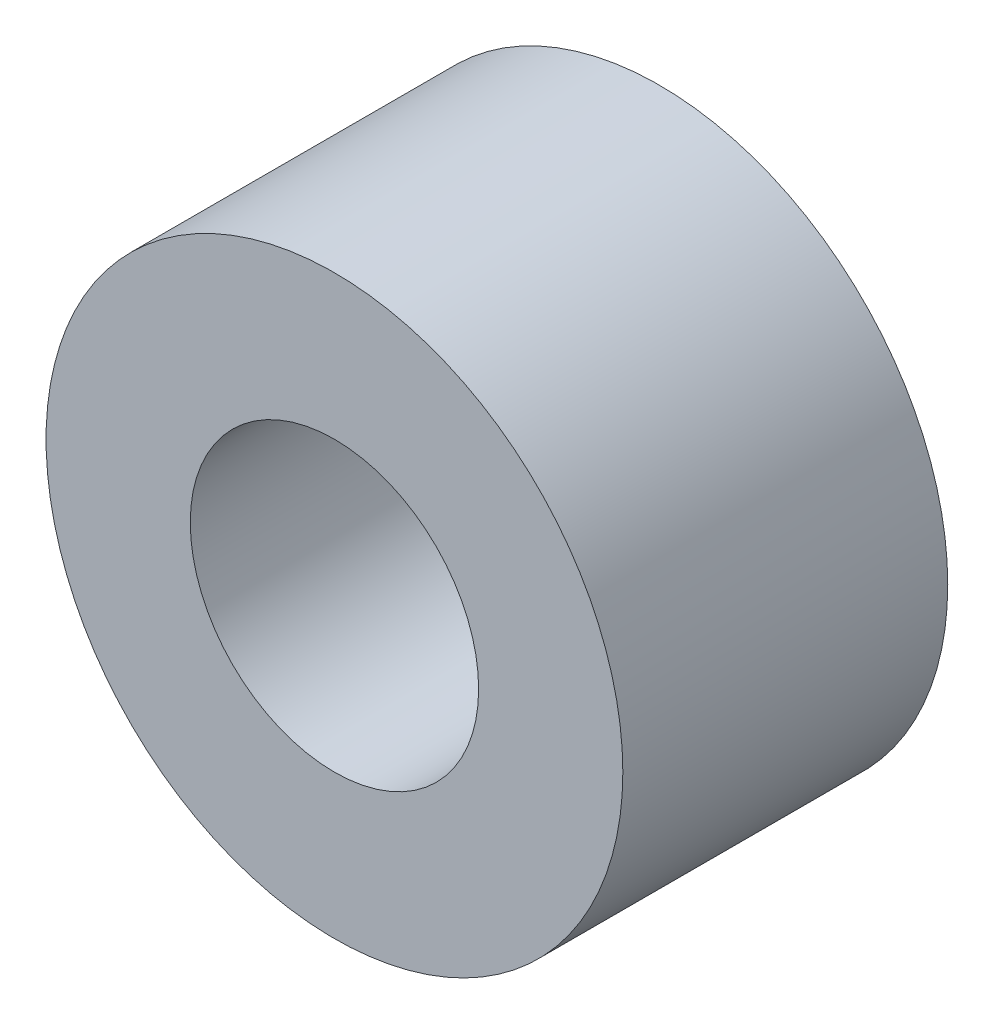
ISO-10303-21;
HEADER;
FILE_DESCRIPTION(('STEP AP214'),'2;1');
FILE_NAME('part.step','',(''),(''),'','','');
FILE_SCHEMA(('AUTOMOTIVE_DESIGN { 1 0 10303 214 1 1 1 1 }'));
ENDSEC;
DATA;
#1=APPLICATION_CONTEXT('core data for automotive mechanical design processes');
#2=APPLICATION_PROTOCOL_DEFINITION('international standard','automotive_design',2000,#1);
#3=PRODUCT_CONTEXT('',#1,'mechanical');
#4=PRODUCT('Part','Part','',(#3));
#5=PRODUCT_RELATED_PRODUCT_CATEGORY('part','',(#4));
#6=PRODUCT_DEFINITION_FORMATION('','',#4);
#7=PRODUCT_DEFINITION_CONTEXT('part definition',#1,'design');
#8=PRODUCT_DEFINITION('design','',#6,#7);
#9=PRODUCT_DEFINITION_SHAPE('','',#8);
#10=(LENGTH_UNIT() NAMED_UNIT(*) SI_UNIT(.MILLI.,.METRE.));
#11=(NAMED_UNIT(*) PLANE_ANGLE_UNIT() SI_UNIT($,.RADIAN.));
#12=(NAMED_UNIT(*) SI_UNIT($,.STERADIAN.) SOLID_ANGLE_UNIT());
#13=UNCERTAINTY_MEASURE_WITH_UNIT(LENGTH_MEASURE(1.E-05),#10,'distance_accuracy_value','');
#14=(GEOMETRIC_REPRESENTATION_CONTEXT(3) GLOBAL_UNCERTAINTY_ASSIGNED_CONTEXT((#13)) GLOBAL_UNIT_ASSIGNED_CONTEXT((#10,
#11,#12)) REPRESENTATION_CONTEXT('',''));
#15=CARTESIAN_POINT('',(0.,0.,0.));
#16=DIRECTION('',(0.,0.,1.));
#17=DIRECTION('',(1.,0.,0.));
#18=AXIS2_PLACEMENT_3D('',#15,#16,#17);
#19=CARTESIAN_POINT('',(0.,0.,3.38));
#20=DIRECTION('',(0.,0.,1.));
#21=DIRECTION('',(1.,0.,0.));
#22=AXIS2_PLACEMENT_3D('',#19,#20,#21);
#23=PLANE('',#22);
#24=CARTESIAN_POINT('',(0.,0.,3.38));
#25=DIRECTION('',(0.,0.,1.));
#26=DIRECTION('',(1.,0.,0.));
#27=AXIS2_PLACEMENT_3D('',#24,#25,#26);
#28=CIRCLE('',#27,3.);
#29=CARTESIAN_POINT('',(3.,0.,3.38));
#30=VERTEX_POINT('',#29);
#31=EDGE_CURVE('E10',#30,#30,#28,.T.);
#32=ORIENTED_EDGE('',*,*,#31,.T.);
#33=EDGE_LOOP('',(#32));
#34=FACE_BOUND('',#33,.T.);
#35=CARTESIAN_POINT('',(0.,0.,3.38));
#36=DIRECTION('',(0.,0.,1.));
#37=DIRECTION('',(1.,0.,0.));
#38=AXIS2_PLACEMENT_3D('',#35,#36,#37);
#39=CIRCLE('',#38,1.5);
#40=CARTESIAN_POINT('',(1.5,0.,3.38));
#41=VERTEX_POINT('',#40);
#42=EDGE_CURVE('E43',#41,#41,#39,.T.);
#43=ORIENTED_EDGE('',*,*,#42,.F.);
#44=EDGE_LOOP('',(#43));
#45=FACE_BOUND('',#44,.T.);
#46=ADVANCED_FACE('F32',(#34,#45),#23,.T.);
#47=CARTESIAN_POINT('',(0.,0.,0.));
#48=DIRECTION('',(0.,0.,1.));
#49=DIRECTION('',(1.,0.,0.));
#50=AXIS2_PLACEMENT_3D('',#47,#48,#49);
#51=PLANE('',#50);
#52=CARTESIAN_POINT('',(0.,0.,0.));
#53=DIRECTION('',(0.,0.,1.));
#54=DIRECTION('',(1.,0.,0.));
#55=AXIS2_PLACEMENT_3D('',#52,#53,#54);
#56=CIRCLE('',#55,3.);
#57=CARTESIAN_POINT('',(3.,0.,0.));
#58=VERTEX_POINT('',#57);
#59=EDGE_CURVE('E36',#58,#58,#56,.T.);
#60=ORIENTED_EDGE('',*,*,#59,.F.);
#61=EDGE_LOOP('',(#60));
#62=FACE_BOUND('',#61,.T.);
#63=CARTESIAN_POINT('',(0.,0.,0.));
#64=DIRECTION('',(0.,0.,1.));
#65=DIRECTION('',(1.,0.,0.));
#66=AXIS2_PLACEMENT_3D('',#63,#64,#65);
#67=CIRCLE('',#66,1.5);
#68=CARTESIAN_POINT('',(1.5,0.,0.));
#69=VERTEX_POINT('',#68);
#70=EDGE_CURVE('E45',#69,#69,#67,.T.);
#71=ORIENTED_EDGE('',*,*,#70,.T.);
#72=EDGE_LOOP('',(#71));
#73=FACE_BOUND('',#72,.T.);
#74=ADVANCED_FACE('F55',(#62,#73),#51,.F.);
#75=CARTESIAN_POINT('',(0.,0.,3.38));
#76=DIRECTION('',(0.,0.,-1.));
#77=DIRECTION('',(-1.,0.,0.));
#78=AXIS2_PLACEMENT_3D('',#75,#76,#77);
#79=CYLINDRICAL_SURFACE('',#78,3.);
#80=ORIENTED_EDGE('',*,*,#31,.F.);
#81=EDGE_LOOP('',(#80));
#82=FACE_BOUND('',#81,.T.);
#83=ORIENTED_EDGE('',*,*,#59,.T.);
#84=EDGE_LOOP('',(#83));
#85=FACE_BOUND('',#84,.T.);
#86=ADVANCED_FACE('F34',(#82,#85),#79,.T.);
#87=CARTESIAN_POINT('',(0.,0.,3.38));
#88=DIRECTION('',(0.,0.,-1.));
#89=DIRECTION('',(-1.,0.,0.));
#90=AXIS2_PLACEMENT_3D('',#87,#88,#89);
#91=CYLINDRICAL_SURFACE('',#90,1.5);
#92=ORIENTED_EDGE('',*,*,#42,.T.);
#93=EDGE_LOOP('',(#92));
#94=FACE_BOUND('',#93,.T.);
#95=ORIENTED_EDGE('',*,*,#70,.F.);
#96=EDGE_LOOP('',(#95));
#97=FACE_BOUND('',#96,.T.);
#98=ADVANCED_FACE('F51',(#94,#97),#91,.F.);
#99=CLOSED_SHELL('',(#46,#74,#86,#98));
#100=MANIFOLD_SOLID_BREP('B2',#99);
#101=ADVANCED_BREP_SHAPE_REPRESENTATION('',(#18,#100),#14);
#102=SHAPE_DEFINITION_REPRESENTATION(#9,#101);
ENDSEC;
END-ISO-10303-21;
